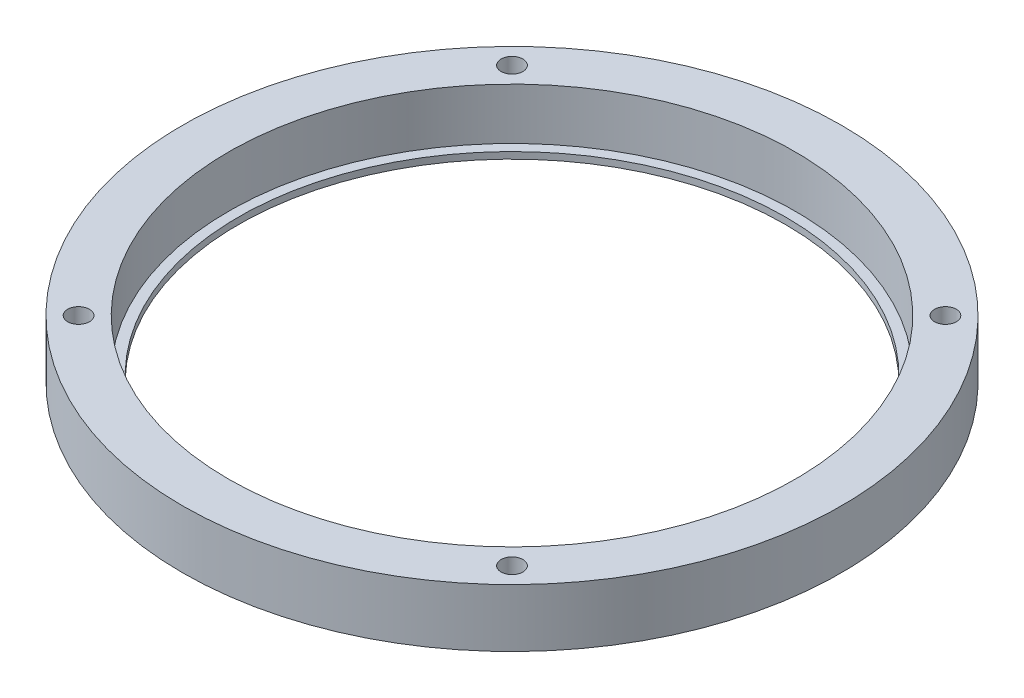
ISO-10303-21;
HEADER;
FILE_DESCRIPTION(('STEP AP214'),'2;1');
FILE_NAME('part.step','',(''),(''),'','','');
FILE_SCHEMA(('AUTOMOTIVE_DESIGN { 1 0 10303 214 1 1 1 1 }'));
ENDSEC;
DATA;
#1=APPLICATION_CONTEXT('core data for automotive mechanical design processes');
#2=APPLICATION_PROTOCOL_DEFINITION('international standard','automotive_design',2000,#1);
#3=PRODUCT_CONTEXT('',#1,'mechanical');
#4=PRODUCT('Part','Part','',(#3));
#5=PRODUCT_RELATED_PRODUCT_CATEGORY('part','',(#4));
#6=PRODUCT_DEFINITION_FORMATION('','',#4);
#7=PRODUCT_DEFINITION_CONTEXT('part definition',#1,'design');
#8=PRODUCT_DEFINITION('design','',#6,#7);
#9=PRODUCT_DEFINITION_SHAPE('','',#8);
#10=(LENGTH_UNIT() NAMED_UNIT(*) SI_UNIT(.MILLI.,.METRE.));
#11=(NAMED_UNIT(*) PLANE_ANGLE_UNIT() SI_UNIT($,.RADIAN.));
#12=(NAMED_UNIT(*) SI_UNIT($,.STERADIAN.) SOLID_ANGLE_UNIT());
#13=UNCERTAINTY_MEASURE_WITH_UNIT(LENGTH_MEASURE(1.E-05),#10,'distance_accuracy_value','');
#14=(GEOMETRIC_REPRESENTATION_CONTEXT(3) GLOBAL_UNCERTAINTY_ASSIGNED_CONTEXT((#13)) GLOBAL_UNIT_ASSIGNED_CONTEXT((#10,
#11,#12)) REPRESENTATION_CONTEXT('',''));
#15=CARTESIAN_POINT('',(0.,0.,0.));
#16=DIRECTION('',(0.,0.,1.));
#17=DIRECTION('',(1.,0.,0.));
#18=AXIS2_PLACEMENT_3D('',#15,#16,#17);
#19=CARTESIAN_POINT('',(0.,7.8,0.));
#20=DIRECTION('',(0.,1.,0.));
#21=DIRECTION('',(0.,0.,1.));
#22=AXIS2_PLACEMENT_3D('',#19,#20,#21);
#23=PLANE('',#22);
#24=CARTESIAN_POINT('',(-32.8804653251745,7.8,-32.8804653251745));
#25=DIRECTION('',(0.,1.,0.));
#26=DIRECTION('',(0.,0.,1.));
#27=AXIS2_PLACEMENT_3D('',#24,#25,#26);
#28=CIRCLE('',#27,1.64999999999999);
#29=CARTESIAN_POINT('',(-32.8804653251745,7.8,-31.2304653251745));
#30=VERTEX_POINT('',#29);
#31=EDGE_CURVE('E81',#30,#30,#28,.T.);
#32=ORIENTED_EDGE('',*,*,#31,.F.);
#33=EDGE_LOOP('',(#32));
#34=FACE_BOUND('',#33,.T.);
#35=CARTESIAN_POINT('',(-32.8804653251745,7.8,32.8804653251745));
#36=DIRECTION('',(0.,1.,0.));
#37=DIRECTION('',(0.,0.,1.));
#38=AXIS2_PLACEMENT_3D('',#35,#36,#37);
#39=CIRCLE('',#38,1.64999999999999);
#40=CARTESIAN_POINT('',(-32.8804653251745,7.8,34.5304653251745));
#41=VERTEX_POINT('',#40);
#42=EDGE_CURVE('E75',#41,#41,#39,.T.);
#43=ORIENTED_EDGE('',*,*,#42,.F.);
#44=EDGE_LOOP('',(#43));
#45=FACE_BOUND('',#44,.T.);
#46=CARTESIAN_POINT('',(32.8804653251745,7.8,32.8804653251745));
#47=DIRECTION('',(0.,1.,0.));
#48=DIRECTION('',(0.,0.,1.));
#49=AXIS2_PLACEMENT_3D('',#46,#47,#48);
#50=CIRCLE('',#49,1.64999999999999);
#51=CARTESIAN_POINT('',(32.8804653251745,7.8,34.5304653251745));
#52=VERTEX_POINT('',#51);
#53=EDGE_CURVE('E69',#52,#52,#50,.T.);
#54=ORIENTED_EDGE('',*,*,#53,.F.);
#55=EDGE_LOOP('',(#54));
#56=FACE_BOUND('',#55,.T.);
#57=CARTESIAN_POINT('',(32.8804653251745,7.8,-32.8804653251745));
#58=DIRECTION('',(0.,1.,0.));
#59=DIRECTION('',(0.,0.,1.));
#60=AXIS2_PLACEMENT_3D('',#57,#58,#59);
#61=CIRCLE('',#60,1.64999999999999);
#62=CARTESIAN_POINT('',(32.8804653251745,7.8,-31.2304653251745));
#63=VERTEX_POINT('',#62);
#64=EDGE_CURVE('E63',#63,#63,#61,.T.);
#65=ORIENTED_EDGE('',*,*,#64,.F.);
#66=EDGE_LOOP('',(#65));
#67=FACE_BOUND('',#66,.T.);
#68=CARTESIAN_POINT('',(0.,7.8,0.));
#69=DIRECTION('',(0.,1.,0.));
#70=DIRECTION('',(0.,0.,1.));
#71=AXIS2_PLACEMENT_3D('',#68,#69,#70);
#72=CIRCLE('',#71,50.);
#73=CARTESIAN_POINT('',(0.,7.8,50.));
#74=VERTEX_POINT('',#73);
#75=EDGE_CURVE('E10',#74,#74,#72,.T.);
#76=ORIENTED_EDGE('',*,*,#75,.T.);
#77=EDGE_LOOP('',(#76));
#78=FACE_BOUND('',#77,.T.);
#79=CARTESIAN_POINT('',(0.,7.8,0.));
#80=DIRECTION('',(0.,1.,0.));
#81=DIRECTION('',(0.,0.,1.));
#82=AXIS2_PLACEMENT_3D('',#79,#80,#81);
#83=CIRCLE('',#82,43.);
#84=CARTESIAN_POINT('',(0.,7.8,43.));
#85=VERTEX_POINT('',#84);
#86=EDGE_CURVE('E41',#85,#85,#83,.T.);
#87=ORIENTED_EDGE('',*,*,#86,.F.);
#88=EDGE_LOOP('',(#87));
#89=FACE_BOUND('',#88,.T.);
#90=ADVANCED_FACE('F34',(#34,#45,#56,#67,#78,#89),#23,.T.);
#91=CARTESIAN_POINT('',(0.,7.8,0.));
#92=DIRECTION('',(0.,-1.,0.));
#93=DIRECTION('',(0.,0.,-1.));
#94=AXIS2_PLACEMENT_3D('',#91,#92,#93);
#95=CYLINDRICAL_SURFACE('',#94,50.);
#96=ORIENTED_EDGE('',*,*,#75,.F.);
#97=EDGE_LOOP('',(#96));
#98=FACE_BOUND('',#97,.T.);
#99=CARTESIAN_POINT('',(0.,-1.,0.));
#100=DIRECTION('',(0.,-1.,0.));
#101=DIRECTION('',(0.,0.,-1.));
#102=AXIS2_PLACEMENT_3D('',#99,#100,#101);
#103=CIRCLE('',#102,50.);
#104=CARTESIAN_POINT('',(0.,-1.,-50.));
#105=VERTEX_POINT('',#104);
#106=EDGE_CURVE('E50',#105,#105,#103,.T.);
#107=ORIENTED_EDGE('',*,*,#106,.F.);
#108=EDGE_LOOP('',(#107));
#109=FACE_BOUND('',#108,.T.);
#110=ADVANCED_FACE('F36',(#98,#109),#95,.T.);
#111=CARTESIAN_POINT('',(0.,7.8,0.));
#112=DIRECTION('',(0.,-1.,0.));
#113=DIRECTION('',(0.,0.,-1.));
#114=AXIS2_PLACEMENT_3D('',#111,#112,#113);
#115=CYLINDRICAL_SURFACE('',#114,43.);
#116=ORIENTED_EDGE('',*,*,#86,.T.);
#117=EDGE_LOOP('',(#116));
#118=FACE_BOUND('',#117,.T.);
#119=CARTESIAN_POINT('',(0.,0.,0.));
#120=DIRECTION('',(0.,1.,0.));
#121=DIRECTION('',(0.,0.,1.));
#122=AXIS2_PLACEMENT_3D('',#119,#120,#121);
#123=CIRCLE('',#122,43.);
#124=CARTESIAN_POINT('',(0.,0.,43.));
#125=VERTEX_POINT('',#124);
#126=EDGE_CURVE('E45',#125,#125,#123,.T.);
#127=ORIENTED_EDGE('',*,*,#126,.F.);
#128=EDGE_LOOP('',(#127));
#129=FACE_BOUND('',#128,.T.);
#130=ADVANCED_FACE('F121',(#118,#129),#115,.F.);
#131=CARTESIAN_POINT('',(0.,0.,0.));
#132=DIRECTION('',(0.,-1.,0.));
#133=DIRECTION('',(0.,0.,-1.));
#134=AXIS2_PLACEMENT_3D('',#131,#132,#133);
#135=PLANE('',#134);
#136=CARTESIAN_POINT('',(0.,0.,0.));
#137=DIRECTION('',(0.,-1.,0.));
#138=DIRECTION('',(0.,0.,-1.));
#139=AXIS2_PLACEMENT_3D('',#136,#137,#138);
#140=CIRCLE('',#139,41.5);
#141=CARTESIAN_POINT('',(0.,0.,-41.5));
#142=VERTEX_POINT('',#141);
#143=EDGE_CURVE('E55',#142,#142,#140,.T.);
#144=ORIENTED_EDGE('',*,*,#143,.T.);
#145=EDGE_LOOP('',(#144));
#146=FACE_BOUND('',#145,.T.);
#147=ORIENTED_EDGE('',*,*,#126,.T.);
#148=EDGE_LOOP('',(#147));
#149=FACE_BOUND('',#148,.T.);
#150=ADVANCED_FACE('F117',(#146,#149),#135,.F.);
#151=CARTESIAN_POINT('',(0.,-1.,0.));
#152=DIRECTION('',(0.,-1.,0.));
#153=DIRECTION('',(0.,0.,-1.));
#154=AXIS2_PLACEMENT_3D('',#151,#152,#153);
#155=PLANE('',#154);
#156=CARTESIAN_POINT('',(-32.8804653251745,-0.999999999999999,-32.8804653251745));
#157=DIRECTION('',(0.,1.,0.));
#158=DIRECTION('',(0.,0.,1.));
#159=AXIS2_PLACEMENT_3D('',#156,#157,#158);
#160=CIRCLE('',#159,1.65);
#161=CARTESIAN_POINT('',(-32.8804653251745,-0.999999999999999,-31.2304653251745));
#162=VERTEX_POINT('',#161);
#163=EDGE_CURVE('E78',#162,#162,#160,.T.);
#164=ORIENTED_EDGE('',*,*,#163,.T.);
#165=EDGE_LOOP('',(#164));
#166=FACE_BOUND('',#165,.T.);
#167=CARTESIAN_POINT('',(-32.8804653251745,-0.999999999999999,32.8804653251745));
#168=DIRECTION('',(0.,1.,0.));
#169=DIRECTION('',(0.,0.,1.));
#170=AXIS2_PLACEMENT_3D('',#167,#168,#169);
#171=CIRCLE('',#170,1.65);
#172=CARTESIAN_POINT('',(-32.8804653251745,-0.999999999999999,34.5304653251745));
#173=VERTEX_POINT('',#172);
#174=EDGE_CURVE('E72',#173,#173,#171,.T.);
#175=ORIENTED_EDGE('',*,*,#174,.T.);
#176=EDGE_LOOP('',(#175));
#177=FACE_BOUND('',#176,.T.);
#178=CARTESIAN_POINT('',(32.8804653251745,-0.999999999999999,32.8804653251745));
#179=DIRECTION('',(0.,1.,0.));
#180=DIRECTION('',(0.,0.,1.));
#181=AXIS2_PLACEMENT_3D('',#178,#179,#180);
#182=CIRCLE('',#181,1.65);
#183=CARTESIAN_POINT('',(32.8804653251745,-0.999999999999999,34.5304653251745));
#184=VERTEX_POINT('',#183);
#185=EDGE_CURVE('E66',#184,#184,#182,.T.);
#186=ORIENTED_EDGE('',*,*,#185,.T.);
#187=EDGE_LOOP('',(#186));
#188=FACE_BOUND('',#187,.T.);
#189=CARTESIAN_POINT('',(32.8804653251745,-0.999999999999999,-32.8804653251745));
#190=DIRECTION('',(0.,1.,0.));
#191=DIRECTION('',(0.,0.,1.));
#192=AXIS2_PLACEMENT_3D('',#189,#190,#191);
#193=CIRCLE('',#192,1.65);
#194=CARTESIAN_POINT('',(32.8804653251745,-0.999999999999999,-31.2304653251745));
#195=VERTEX_POINT('',#194);
#196=EDGE_CURVE('E58',#195,#195,#193,.T.);
#197=ORIENTED_EDGE('',*,*,#196,.T.);
#198=EDGE_LOOP('',(#197));
#199=FACE_BOUND('',#198,.T.);
#200=ORIENTED_EDGE('',*,*,#106,.T.);
#201=EDGE_LOOP('',(#200));
#202=FACE_BOUND('',#201,.T.);
#203=CARTESIAN_POINT('',(0.,-1.,0.));
#204=DIRECTION('',(0.,-1.,0.));
#205=DIRECTION('',(0.,0.,-1.));
#206=AXIS2_PLACEMENT_3D('',#203,#204,#205);
#207=CIRCLE('',#206,41.5);
#208=CARTESIAN_POINT('',(0.,-1.,-41.5));
#209=VERTEX_POINT('',#208);
#210=EDGE_CURVE('E54',#209,#209,#207,.T.);
#211=ORIENTED_EDGE('',*,*,#210,.F.);
#212=EDGE_LOOP('',(#211));
#213=FACE_BOUND('',#212,.T.);
#214=ADVANCED_FACE('F109',(#166,#177,#188,#199,#202,#213),#155,.T.);
#215=CARTESIAN_POINT('',(0.,-1.,0.));
#216=DIRECTION('',(0.,1.,0.));
#217=DIRECTION('',(0.,0.,1.));
#218=AXIS2_PLACEMENT_3D('',#215,#216,#217);
#219=CYLINDRICAL_SURFACE('',#218,41.5);
#220=ORIENTED_EDGE('',*,*,#210,.T.);
#221=EDGE_LOOP('',(#220));
#222=FACE_BOUND('',#221,.T.);
#223=ORIENTED_EDGE('',*,*,#143,.F.);
#224=EDGE_LOOP('',(#223));
#225=FACE_BOUND('',#224,.T.);
#226=ADVANCED_FACE('F99',(#222,#225),#219,.F.);
#227=CARTESIAN_POINT('',(32.8804653251745,7.8,-32.8804653251745));
#228=DIRECTION('',(0.,1.,0.));
#229=DIRECTION('',(0.,0.,1.));
#230=AXIS2_PLACEMENT_3D('',#227,#228,#229);
#231=CYLINDRICAL_SURFACE('',#230,1.65);
#232=ORIENTED_EDGE('',*,*,#196,.F.);
#233=EDGE_LOOP('',(#232));
#234=FACE_BOUND('',#233,.T.);
#235=ORIENTED_EDGE('',*,*,#64,.T.);
#236=EDGE_LOOP('',(#235));
#237=FACE_BOUND('',#236,.T.);
#238=ADVANCED_FACE('F96',(#234,#237),#231,.F.);
#239=CARTESIAN_POINT('',(32.8804653251745,7.8,32.8804653251745));
#240=DIRECTION('',(0.,1.,0.));
#241=DIRECTION('',(0.,0.,1.));
#242=AXIS2_PLACEMENT_3D('',#239,#240,#241);
#243=CYLINDRICAL_SURFACE('',#242,1.65);
#244=ORIENTED_EDGE('',*,*,#185,.F.);
#245=EDGE_LOOP('',(#244));
#246=FACE_BOUND('',#245,.T.);
#247=ORIENTED_EDGE('',*,*,#53,.T.);
#248=EDGE_LOOP('',(#247));
#249=FACE_BOUND('',#248,.T.);
#250=ADVANCED_FACE('F98',(#246,#249),#243,.F.);
#251=CARTESIAN_POINT('',(-32.8804653251745,7.8,32.8804653251745));
#252=DIRECTION('',(0.,1.,0.));
#253=DIRECTION('',(0.,0.,1.));
#254=AXIS2_PLACEMENT_3D('',#251,#252,#253);
#255=CYLINDRICAL_SURFACE('',#254,1.64999999999999);
#256=ORIENTED_EDGE('',*,*,#174,.F.);
#257=EDGE_LOOP('',(#256));
#258=FACE_BOUND('',#257,.T.);
#259=ORIENTED_EDGE('',*,*,#42,.T.);
#260=EDGE_LOOP('',(#259));
#261=FACE_BOUND('',#260,.T.);
#262=ADVANCED_FACE('F106',(#258,#261),#255,.F.);
#263=CARTESIAN_POINT('',(-32.8804653251745,7.8,-32.8804653251745));
#264=DIRECTION('',(0.,1.,0.));
#265=DIRECTION('',(0.,0.,1.));
#266=AXIS2_PLACEMENT_3D('',#263,#264,#265);
#267=CYLINDRICAL_SURFACE('',#266,1.64999999999999);
#268=ORIENTED_EDGE('',*,*,#163,.F.);
#269=EDGE_LOOP('',(#268));
#270=FACE_BOUND('',#269,.T.);
#271=ORIENTED_EDGE('',*,*,#31,.T.);
#272=EDGE_LOOP('',(#271));
#273=FACE_BOUND('',#272,.T.);
#274=ADVANCED_FACE('F85',(#270,#273),#267,.F.);
#275=CLOSED_SHELL('',(#90,#110,#130,#150,#214,#226,#238,#250,#262,#274));
#276=MANIFOLD_SOLID_BREP('B2',#275);
#277=ADVANCED_BREP_SHAPE_REPRESENTATION('',(#18,#276),#14);
#278=SHAPE_DEFINITION_REPRESENTATION(#9,#277);
ENDSEC;
END-ISO-10303-21;
